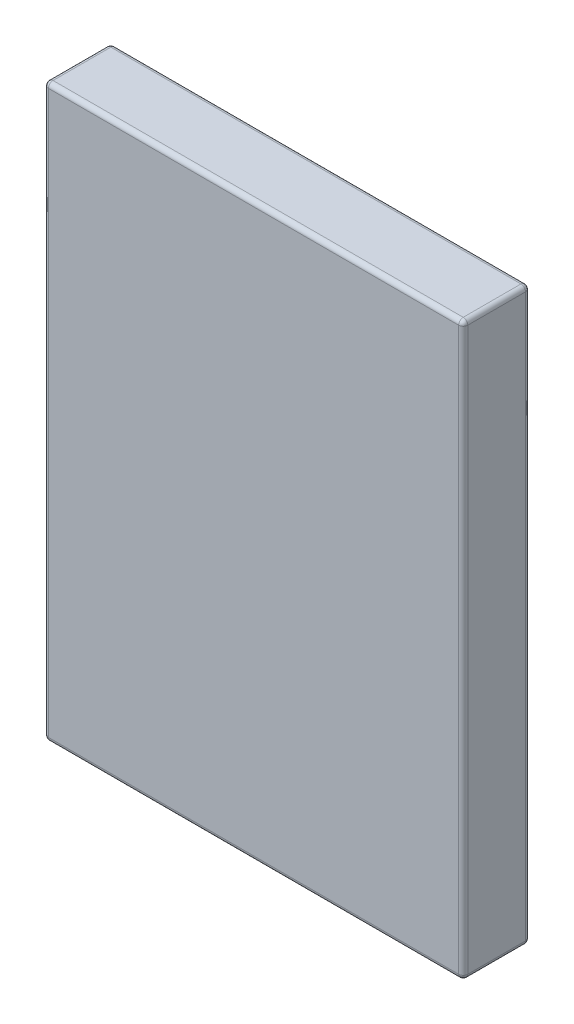
ISO-10303-21;
HEADER;
FILE_DESCRIPTION(('STEP AP214'),'2;1');
FILE_NAME('part.step','',(''),(''),'','','');
FILE_SCHEMA(('AUTOMOTIVE_DESIGN { 1 0 10303 214 1 1 1 1 }'));
ENDSEC;
DATA;
#1=APPLICATION_CONTEXT('core data for automotive mechanical design processes');
#2=APPLICATION_PROTOCOL_DEFINITION('international standard','automotive_design',2000,#1);
#3=PRODUCT_CONTEXT('',#1,'mechanical');
#4=PRODUCT('Part','Part','',(#3));
#5=PRODUCT_RELATED_PRODUCT_CATEGORY('part','',(#4));
#6=PRODUCT_DEFINITION_FORMATION('','',#4);
#7=PRODUCT_DEFINITION_CONTEXT('part definition',#1,'design');
#8=PRODUCT_DEFINITION('design','',#6,#7);
#9=PRODUCT_DEFINITION_SHAPE('','',#8);
#10=(LENGTH_UNIT() NAMED_UNIT(*) SI_UNIT(.MILLI.,.METRE.));
#11=(NAMED_UNIT(*) PLANE_ANGLE_UNIT() SI_UNIT($,.RADIAN.));
#12=(NAMED_UNIT(*) SI_UNIT($,.STERADIAN.) SOLID_ANGLE_UNIT());
#13=UNCERTAINTY_MEASURE_WITH_UNIT(LENGTH_MEASURE(1.E-05),#10,'distance_accuracy_value','');
#14=(GEOMETRIC_REPRESENTATION_CONTEXT(3) GLOBAL_UNCERTAINTY_ASSIGNED_CONTEXT((#13)) GLOBAL_UNIT_ASSIGNED_CONTEXT((#10,
#11,#12)) REPRESENTATION_CONTEXT('',''));
#15=CARTESIAN_POINT('',(0.,0.,0.));
#16=DIRECTION('',(0.,0.,1.));
#17=DIRECTION('',(1.,0.,0.));
#18=AXIS2_PLACEMENT_3D('',#15,#16,#17);
#19=CARTESIAN_POINT('',(0.,0.,220.));
#20=DIRECTION('',(1.,0.,0.));
#21=DIRECTION('',(0.,0.,-1.));
#22=AXIS2_PLACEMENT_3D('',#19,#20,#21);
#23=PLANE('',#22);
#24=DIRECTION('',(0.,-1.,0.));
#25=VECTOR('',#24,1.);
#26=CARTESIAN_POINT('',(0.,0.,15.));
#27=LINE('',#26,#25);
#28=CARTESIAN_POINT('',(0.,1865.,15.));
#29=VERTEX_POINT('',#28);
#30=CARTESIAN_POINT('',(0.,15.,15.));
#31=VERTEX_POINT('',#30);
#32=EDGE_CURVE('E262',#29,#31,#27,.T.);
#33=ORIENTED_EDGE('',*,*,#32,.T.);
#34=DIRECTION('',(0.,0.,-1.));
#35=VECTOR('',#34,1.);
#36=CARTESIAN_POINT('',(0.,15.,220.));
#37=LINE('',#36,#35);
#38=CARTESIAN_POINT('',(0.,15.,205.));
#39=VERTEX_POINT('',#38);
#40=EDGE_CURVE('E265',#31,#39,#37,.F.);
#41=ORIENTED_EDGE('',*,*,#40,.T.);
#42=DIRECTION('',(0.,-1.,0.));
#43=VECTOR('',#42,1.);
#44=CARTESIAN_POINT('',(0.,0.,205.));
#45=LINE('',#44,#43);
#46=CARTESIAN_POINT('',(0.,1865.,205.));
#47=VERTEX_POINT('',#46);
#48=EDGE_CURVE('E240',#39,#47,#45,.F.);
#49=ORIENTED_EDGE('',*,*,#48,.T.);
#50=DIRECTION('',(0.,0.,-1.));
#51=VECTOR('',#50,1.);
#52=CARTESIAN_POINT('',(0.,1865.,220.));
#53=LINE('',#52,#51);
#54=EDGE_CURVE('E259',#47,#29,#53,.T.);
#55=ORIENTED_EDGE('',*,*,#54,.T.);
#56=EDGE_LOOP('',(#33,#41,#49,#55));
#57=FACE_BOUND('',#56,.T.);
#58=ADVANCED_FACE('F39',(#57),#23,.F.);
#59=CARTESIAN_POINT('',(0.,0.,220.));
#60=DIRECTION('',(0.,1.,0.));
#61=DIRECTION('',(0.,0.,1.));
#62=AXIS2_PLACEMENT_3D('',#59,#60,#61);
#63=PLANE('',#62);
#64=DIRECTION('',(1.,0.,0.));
#65=VECTOR('',#64,1.);
#66=CARTESIAN_POINT('',(1380.,0.,15.));
#67=LINE('',#66,#65);
#68=CARTESIAN_POINT('',(15.,0.,15.));
#69=VERTEX_POINT('',#68);
#70=CARTESIAN_POINT('',(1365.,0.,15.));
#71=VERTEX_POINT('',#70);
#72=EDGE_CURVE('E308',#69,#71,#67,.T.);
#73=ORIENTED_EDGE('',*,*,#72,.T.);
#74=DIRECTION('',(0.,0.,-1.));
#75=VECTOR('',#74,1.);
#76=CARTESIAN_POINT('',(1365.,0.,220.));
#77=LINE('',#76,#75);
#78=CARTESIAN_POINT('',(1365.,0.,205.));
#79=VERTEX_POINT('',#78);
#80=EDGE_CURVE('E312',#71,#79,#77,.F.);
#81=ORIENTED_EDGE('',*,*,#80,.T.);
#82=DIRECTION('',(1.,0.,0.));
#83=VECTOR('',#82,1.);
#84=CARTESIAN_POINT('',(0.,0.,205.));
#85=LINE('',#84,#83);
#86=CARTESIAN_POINT('',(15.,0.,205.));
#87=VERTEX_POINT('',#86);
#88=EDGE_CURVE('E302',#79,#87,#85,.F.);
#89=ORIENTED_EDGE('',*,*,#88,.T.);
#90=DIRECTION('',(0.,0.,-1.));
#91=VECTOR('',#90,1.);
#92=CARTESIAN_POINT('',(15.,0.,220.));
#93=LINE('',#92,#91);
#94=EDGE_CURVE('E309',#87,#69,#93,.T.);
#95=ORIENTED_EDGE('',*,*,#94,.T.);
#96=EDGE_LOOP('',(#73,#81,#89,#95));
#97=FACE_BOUND('',#96,.T.);
#98=ADVANCED_FACE('F313',(#97),#63,.F.);
#99=CARTESIAN_POINT('',(1380.,0.,220.));
#100=DIRECTION('',(-1.,0.,0.));
#101=DIRECTION('',(0.,0.,1.));
#102=AXIS2_PLACEMENT_3D('',#99,#100,#101);
#103=PLANE('',#102);
#104=DIRECTION('',(0.,1.,0.));
#105=VECTOR('',#104,1.);
#106=CARTESIAN_POINT('',(1380.,0.,205.));
#107=LINE('',#106,#105);
#108=CARTESIAN_POINT('',(1380.,1865.,205.));
#109=VERTEX_POINT('',#108);
#110=CARTESIAN_POINT('',(1380.,15.,205.));
#111=VERTEX_POINT('',#110);
#112=EDGE_CURVE('E142',#109,#111,#107,.F.);
#113=ORIENTED_EDGE('',*,*,#112,.T.);
#114=DIRECTION('',(0.,0.,-1.));
#115=VECTOR('',#114,1.);
#116=CARTESIAN_POINT('',(1380.,15.,220.));
#117=LINE('',#116,#115);
#118=CARTESIAN_POINT('',(1380.,15.,15.));
#119=VERTEX_POINT('',#118);
#120=EDGE_CURVE('E137',#111,#119,#117,.T.);
#121=ORIENTED_EDGE('',*,*,#120,.T.);
#122=DIRECTION('',(0.,1.,0.));
#123=VECTOR('',#122,1.);
#124=CARTESIAN_POINT('',(1380.,1880.,15.));
#125=LINE('',#124,#123);
#126=CARTESIAN_POINT('',(1380.,1865.,15.));
#127=VERTEX_POINT('',#126);
#128=EDGE_CURVE('E131',#119,#127,#125,.T.);
#129=ORIENTED_EDGE('',*,*,#128,.T.);
#130=DIRECTION('',(0.,0.,-1.));
#131=VECTOR('',#130,1.);
#132=CARTESIAN_POINT('',(1380.,1865.,220.));
#133=LINE('',#132,#131);
#134=EDGE_CURVE('E134',#127,#109,#133,.F.);
#135=ORIENTED_EDGE('',*,*,#134,.T.);
#136=EDGE_LOOP('',(#113,#121,#129,#135));
#137=FACE_BOUND('',#136,.T.);
#138=ADVANCED_FACE('F133',(#137),#103,.F.);
#139=CARTESIAN_POINT('',(0.,1880.,220.));
#140=DIRECTION('',(0.,-1.,0.));
#141=DIRECTION('',(0.,0.,-1.));
#142=AXIS2_PLACEMENT_3D('',#139,#140,#141);
#143=PLANE('',#142);
#144=DIRECTION('',(-1.,0.,0.));
#145=VECTOR('',#144,1.);
#146=CARTESIAN_POINT('',(0.,1880.,15.));
#147=LINE('',#146,#145);
#148=CARTESIAN_POINT('',(1365.,1880.,15.));
#149=VERTEX_POINT('',#148);
#150=CARTESIAN_POINT('',(15.,1880.,15.));
#151=VERTEX_POINT('',#150);
#152=EDGE_CURVE('E49',#149,#151,#147,.T.);
#153=ORIENTED_EDGE('',*,*,#152,.T.);
#154=DIRECTION('',(0.,0.,-1.));
#155=VECTOR('',#154,1.);
#156=CARTESIAN_POINT('',(15.,1880.,220.));
#157=LINE('',#156,#155);
#158=CARTESIAN_POINT('',(15.,1880.,205.));
#159=VERTEX_POINT('',#158);
#160=EDGE_CURVE('E11',#151,#159,#157,.F.);
#161=ORIENTED_EDGE('',*,*,#160,.T.);
#162=DIRECTION('',(-1.,0.,0.));
#163=VECTOR('',#162,1.);
#164=CARTESIAN_POINT('',(0.,1880.,205.));
#165=LINE('',#164,#163);
#166=CARTESIAN_POINT('',(1365.,1880.,205.));
#167=VERTEX_POINT('',#166);
#168=EDGE_CURVE('E63',#159,#167,#165,.F.);
#169=ORIENTED_EDGE('',*,*,#168,.T.);
#170=DIRECTION('',(0.,0.,-1.));
#171=VECTOR('',#170,1.);
#172=CARTESIAN_POINT('',(1365.,1880.,220.));
#173=LINE('',#172,#171);
#174=EDGE_CURVE('E268',#167,#149,#173,.T.);
#175=ORIENTED_EDGE('',*,*,#174,.T.);
#176=EDGE_LOOP('',(#153,#161,#169,#175));
#177=FACE_BOUND('',#176,.T.);
#178=ADVANCED_FACE('F381',(#177),#143,.F.);
#179=CARTESIAN_POINT('',(0.,0.,220.));
#180=DIRECTION('',(0.,0.,-1.));
#181=DIRECTION('',(-1.,0.,0.));
#182=AXIS2_PLACEMENT_3D('',#179,#180,#181);
#183=PLANE('',#182);
#184=DIRECTION('',(0.,-1.,0.));
#185=VECTOR('',#184,1.);
#186=CARTESIAN_POINT('',(15.,0.,220.));
#187=LINE('',#186,#185);
#188=CARTESIAN_POINT('',(15.,1865.,220.));
#189=VERTEX_POINT('',#188);
#190=CARTESIAN_POINT('',(15.,15.,220.));
#191=VERTEX_POINT('',#190);
#192=EDGE_CURVE('E242',#189,#191,#187,.T.);
#193=ORIENTED_EDGE('',*,*,#192,.T.);
#194=DIRECTION('',(1.,0.,0.));
#195=VECTOR('',#194,1.);
#196=CARTESIAN_POINT('',(0.,15.,220.));
#197=LINE('',#196,#195);
#198=CARTESIAN_POINT('',(1365.,15.,220.));
#199=VERTEX_POINT('',#198);
#200=EDGE_CURVE('E247',#191,#199,#197,.T.);
#201=ORIENTED_EDGE('',*,*,#200,.T.);
#202=DIRECTION('',(0.,1.,0.));
#203=VECTOR('',#202,1.);
#204=CARTESIAN_POINT('',(1365.,0.,220.));
#205=LINE('',#204,#203);
#206=CARTESIAN_POINT('',(1365.,1865.,220.));
#207=VERTEX_POINT('',#206);
#208=EDGE_CURVE('E253',#199,#207,#205,.T.);
#209=ORIENTED_EDGE('',*,*,#208,.T.);
#210=DIRECTION('',(-1.,0.,0.));
#211=VECTOR('',#210,1.);
#212=CARTESIAN_POINT('',(0.,1865.,220.));
#213=LINE('',#212,#211);
#214=EDGE_CURVE('E248',#207,#189,#213,.T.);
#215=ORIENTED_EDGE('',*,*,#214,.T.);
#216=EDGE_LOOP('',(#193,#201,#209,#215));
#217=FACE_BOUND('',#216,.T.);
#218=ADVANCED_FACE('F336',(#217),#183,.F.);
#219=CARTESIAN_POINT('',(0.,0.,0.));
#220=DIRECTION('',(0.,0.,-1.));
#221=DIRECTION('',(-1.,0.,0.));
#222=AXIS2_PLACEMENT_3D('',#219,#220,#221);
#223=PLANE('',#222);
#224=DIRECTION('',(0.,1.,0.));
#225=VECTOR('',#224,1.);
#226=CARTESIAN_POINT('',(1365.,0.,0.));
#227=LINE('',#226,#225);
#228=CARTESIAN_POINT('',(1365.,1865.,0.));
#229=VERTEX_POINT('',#228);
#230=CARTESIAN_POINT('',(1365.,15.,0.));
#231=VERTEX_POINT('',#230);
#232=EDGE_CURVE('E166',#229,#231,#227,.F.);
#233=ORIENTED_EDGE('',*,*,#232,.T.);
#234=DIRECTION('',(1.,0.,0.));
#235=VECTOR('',#234,1.);
#236=CARTESIAN_POINT('',(0.,15.,0.));
#237=LINE('',#236,#235);
#238=CARTESIAN_POINT('',(15.,15.,0.));
#239=VERTEX_POINT('',#238);
#240=EDGE_CURVE('E331',#231,#239,#237,.F.);
#241=ORIENTED_EDGE('',*,*,#240,.T.);
#242=DIRECTION('',(0.,-1.,0.));
#243=VECTOR('',#242,1.);
#244=CARTESIAN_POINT('',(15.,1880.,0.));
#245=LINE('',#244,#243);
#246=CARTESIAN_POINT('',(15.,1865.,0.));
#247=VERTEX_POINT('',#246);
#248=EDGE_CURVE('E328',#239,#247,#245,.F.);
#249=ORIENTED_EDGE('',*,*,#248,.T.);
#250=DIRECTION('',(-1.,0.,0.));
#251=VECTOR('',#250,1.);
#252=CARTESIAN_POINT('',(1380.,1865.,0.));
#253=LINE('',#252,#251);
#254=EDGE_CURVE('E322',#247,#229,#253,.F.);
#255=ORIENTED_EDGE('',*,*,#254,.T.);
#256=EDGE_LOOP('',(#233,#241,#249,#255));
#257=FACE_BOUND('',#256,.T.);
#258=ADVANCED_FACE('F384',(#257),#223,.T.);
#259=CARTESIAN_POINT('',(15.,1865.,220.));
#260=DIRECTION('',(0.,0.,-1.));
#261=DIRECTION('',(-1.,0.,0.));
#262=AXIS2_PLACEMENT_3D('',#259,#260,#261);
#263=CYLINDRICAL_SURFACE('',#262,15.);
#264=CARTESIAN_POINT('',(15.,1865.,205.));
#265=DIRECTION('',(0.,0.,1.));
#266=DIRECTION('',(1.,0.,0.));
#267=AXIS2_PLACEMENT_3D('',#264,#265,#266);
#268=CIRCLE('',#267,15.);
#269=EDGE_CURVE('E43',#159,#47,#268,.T.);
#270=ORIENTED_EDGE('',*,*,#269,.F.);
#271=ORIENTED_EDGE('',*,*,#160,.F.);
#272=CARTESIAN_POINT('',(15.,1865.,15.));
#273=DIRECTION('',(0.,0.,-1.));
#274=DIRECTION('',(-1.,0.,0.));
#275=AXIS2_PLACEMENT_3D('',#272,#273,#274);
#276=CIRCLE('',#275,15.);
#277=EDGE_CURVE('E220',#29,#151,#276,.T.);
#278=ORIENTED_EDGE('',*,*,#277,.F.);
#279=ORIENTED_EDGE('',*,*,#54,.F.);
#280=EDGE_LOOP('',(#270,#271,#278,#279));
#281=FACE_BOUND('',#280,.T.);
#282=ADVANCED_FACE('F41',(#281),#263,.T.);
#283=CARTESIAN_POINT('',(15.,1865.,205.));
#284=DIRECTION('',(0.,0.,1.));
#285=DIRECTION('',(1.,0.,0.));
#286=AXIS2_PLACEMENT_3D('',#283,#284,#285);
#287=SPHERICAL_SURFACE('',#286,15.);
#288=CARTESIAN_POINT('',(15.,1865.,205.));
#289=DIRECTION('',(-1.,0.,0.));
#290=DIRECTION('',(0.,0.,1.));
#291=AXIS2_PLACEMENT_3D('',#288,#289,#290);
#292=CIRCLE('',#291,15.);
#293=EDGE_CURVE('E214',#159,#189,#292,.F.);
#294=ORIENTED_EDGE('',*,*,#293,.F.);
#295=ORIENTED_EDGE('',*,*,#269,.T.);
#296=CARTESIAN_POINT('',(15.,1865.,205.));
#297=DIRECTION('',(0.,1.,0.));
#298=DIRECTION('',(0.,0.,1.));
#299=AXIS2_PLACEMENT_3D('',#296,#297,#298);
#300=CIRCLE('',#299,15.);
#301=EDGE_CURVE('E217',#189,#47,#300,.F.);
#302=ORIENTED_EDGE('',*,*,#301,.F.);
#303=EDGE_LOOP('',(#294,#295,#302));
#304=FACE_BOUND('',#303,.T.);
#305=ADVANCED_FACE('F232',(#304),#287,.T.);
#306=CARTESIAN_POINT('',(15.,1865.,15.));
#307=DIRECTION('',(0.,0.,1.));
#308=DIRECTION('',(1.,0.,0.));
#309=AXIS2_PLACEMENT_3D('',#306,#307,#308);
#310=SPHERICAL_SURFACE('',#309,15.);
#311=CARTESIAN_POINT('',(15.,1865.,15.));
#312=DIRECTION('',(0.,1.,0.));
#313=DIRECTION('',(0.,0.,1.));
#314=AXIS2_PLACEMENT_3D('',#311,#312,#313);
#315=CIRCLE('',#314,15.);
#316=EDGE_CURVE('E206',#29,#247,#315,.F.);
#317=ORIENTED_EDGE('',*,*,#316,.F.);
#318=ORIENTED_EDGE('',*,*,#277,.T.);
#319=CARTESIAN_POINT('',(15.,1865.,15.));
#320=DIRECTION('',(-1.,0.,0.));
#321=DIRECTION('',(0.,0.,1.));
#322=AXIS2_PLACEMENT_3D('',#319,#320,#321);
#323=CIRCLE('',#322,15.);
#324=EDGE_CURVE('E210',#247,#151,#323,.F.);
#325=ORIENTED_EDGE('',*,*,#324,.F.);
#326=EDGE_LOOP('',(#317,#318,#325));
#327=FACE_BOUND('',#326,.T.);
#328=ADVANCED_FACE('F408',(#327),#310,.T.);
#329=CARTESIAN_POINT('',(15.,0.,205.));
#330=DIRECTION('',(0.,-1.,0.));
#331=DIRECTION('',(0.,0.,-1.));
#332=AXIS2_PLACEMENT_3D('',#329,#330,#331);
#333=CYLINDRICAL_SURFACE('',#332,15.);
#334=ORIENTED_EDGE('',*,*,#301,.T.);
#335=ORIENTED_EDGE('',*,*,#48,.F.);
#336=CARTESIAN_POINT('',(15.,15.,205.));
#337=DIRECTION('',(0.,-1.,0.));
#338=DIRECTION('',(0.,0.,-1.));
#339=AXIS2_PLACEMENT_3D('',#336,#337,#338);
#340=CIRCLE('',#339,15.);
#341=EDGE_CURVE('E199',#191,#39,#340,.T.);
#342=ORIENTED_EDGE('',*,*,#341,.F.);
#343=ORIENTED_EDGE('',*,*,#192,.F.);
#344=EDGE_LOOP('',(#334,#335,#342,#343));
#345=FACE_BOUND('',#344,.T.);
#346=ADVANCED_FACE('F238',(#345),#333,.T.);
#347=CARTESIAN_POINT('',(0.,1865.,205.));
#348=DIRECTION('',(-1.,0.,0.));
#349=DIRECTION('',(0.,0.,1.));
#350=AXIS2_PLACEMENT_3D('',#347,#348,#349);
#351=CYLINDRICAL_SURFACE('',#350,15.);
#352=ORIENTED_EDGE('',*,*,#293,.T.);
#353=ORIENTED_EDGE('',*,*,#214,.F.);
#354=CARTESIAN_POINT('',(1365.,1865.,205.));
#355=DIRECTION('',(1.,0.,0.));
#356=DIRECTION('',(0.,0.,-1.));
#357=AXIS2_PLACEMENT_3D('',#354,#355,#356);
#358=CIRCLE('',#357,15.);
#359=EDGE_CURVE('E195',#167,#207,#358,.T.);
#360=ORIENTED_EDGE('',*,*,#359,.F.);
#361=ORIENTED_EDGE('',*,*,#168,.F.);
#362=EDGE_LOOP('',(#352,#353,#360,#361));
#363=FACE_BOUND('',#362,.T.);
#364=ADVANCED_FACE('F338',(#363),#351,.T.);
#365=CARTESIAN_POINT('',(1365.,1865.,220.));
#366=DIRECTION('',(0.,0.,-1.));
#367=DIRECTION('',(-1.,0.,0.));
#368=AXIS2_PLACEMENT_3D('',#365,#366,#367);
#369=CYLINDRICAL_SURFACE('',#368,15.);
#370=CARTESIAN_POINT('',(1365.,1865.,15.));
#371=DIRECTION('',(0.,0.,-1.));
#372=DIRECTION('',(-1.,0.,0.));
#373=AXIS2_PLACEMENT_3D('',#370,#371,#372);
#374=CIRCLE('',#373,15.);
#375=EDGE_CURVE('E149',#149,#127,#374,.T.);
#376=ORIENTED_EDGE('',*,*,#375,.F.);
#377=ORIENTED_EDGE('',*,*,#174,.F.);
#378=CARTESIAN_POINT('',(1365.,1865.,205.));
#379=DIRECTION('',(0.,0.,1.));
#380=DIRECTION('',(1.,0.,0.));
#381=AXIS2_PLACEMENT_3D('',#378,#379,#380);
#382=CIRCLE('',#381,15.);
#383=EDGE_CURVE('E152',#109,#167,#382,.T.);
#384=ORIENTED_EDGE('',*,*,#383,.F.);
#385=ORIENTED_EDGE('',*,*,#134,.F.);
#386=EDGE_LOOP('',(#376,#377,#384,#385));
#387=FACE_BOUND('',#386,.T.);
#388=ADVANCED_FACE('F147',(#387),#369,.T.);
#389=CARTESIAN_POINT('',(0.,1865.,15.));
#390=DIRECTION('',(1.,0.,0.));
#391=DIRECTION('',(0.,0.,-1.));
#392=AXIS2_PLACEMENT_3D('',#389,#390,#391);
#393=CYLINDRICAL_SURFACE('',#392,15.);
#394=ORIENTED_EDGE('',*,*,#324,.T.);
#395=ORIENTED_EDGE('',*,*,#152,.F.);
#396=CARTESIAN_POINT('',(1365.,1865.,15.));
#397=DIRECTION('',(1.,0.,0.));
#398=DIRECTION('',(0.,0.,-1.));
#399=AXIS2_PLACEMENT_3D('',#396,#397,#398);
#400=CIRCLE('',#399,15.);
#401=EDGE_CURVE('E162',#229,#149,#400,.T.);
#402=ORIENTED_EDGE('',*,*,#401,.F.);
#403=ORIENTED_EDGE('',*,*,#254,.F.);
#404=EDGE_LOOP('',(#394,#395,#402,#403));
#405=FACE_BOUND('',#404,.T.);
#406=ADVANCED_FACE('F432',(#405),#393,.T.);
#407=CARTESIAN_POINT('',(15.,0.,15.));
#408=DIRECTION('',(0.,1.,0.));
#409=DIRECTION('',(0.,0.,1.));
#410=AXIS2_PLACEMENT_3D('',#407,#408,#409);
#411=CYLINDRICAL_SURFACE('',#410,15.);
#412=ORIENTED_EDGE('',*,*,#316,.T.);
#413=ORIENTED_EDGE('',*,*,#248,.F.);
#414=CARTESIAN_POINT('',(15.,15.,15.));
#415=DIRECTION('',(0.,-1.,0.));
#416=DIRECTION('',(0.,0.,-1.));
#417=AXIS2_PLACEMENT_3D('',#414,#415,#416);
#418=CIRCLE('',#417,15.);
#419=EDGE_CURVE('E187',#31,#239,#418,.T.);
#420=ORIENTED_EDGE('',*,*,#419,.F.);
#421=ORIENTED_EDGE('',*,*,#32,.F.);
#422=EDGE_LOOP('',(#412,#413,#420,#421));
#423=FACE_BOUND('',#422,.T.);
#424=ADVANCED_FACE('F439',(#423),#411,.T.);
#425=CARTESIAN_POINT('',(15.,15.,220.));
#426=DIRECTION('',(0.,0.,-1.));
#427=DIRECTION('',(-1.,0.,0.));
#428=AXIS2_PLACEMENT_3D('',#425,#426,#427);
#429=CYLINDRICAL_SURFACE('',#428,15.);
#430=CARTESIAN_POINT('',(15.,15.,205.));
#431=DIRECTION('',(0.,0.,1.));
#432=DIRECTION('',(1.,0.,0.));
#433=AXIS2_PLACEMENT_3D('',#430,#431,#432);
#434=CIRCLE('',#433,15.);
#435=EDGE_CURVE('E202',#39,#87,#434,.T.);
#436=ORIENTED_EDGE('',*,*,#435,.F.);
#437=ORIENTED_EDGE('',*,*,#40,.F.);
#438=CARTESIAN_POINT('',(15.,15.,15.));
#439=DIRECTION('',(0.,0.,-1.));
#440=DIRECTION('',(-1.,0.,0.));
#441=AXIS2_PLACEMENT_3D('',#438,#439,#440);
#442=CIRCLE('',#441,15.);
#443=EDGE_CURVE('E183',#69,#31,#442,.T.);
#444=ORIENTED_EDGE('',*,*,#443,.F.);
#445=ORIENTED_EDGE('',*,*,#94,.F.);
#446=EDGE_LOOP('',(#436,#437,#444,#445));
#447=FACE_BOUND('',#446,.T.);
#448=ADVANCED_FACE('F354',(#447),#429,.T.);
#449=CARTESIAN_POINT('',(15.,15.,205.));
#450=DIRECTION('',(0.,0.,1.));
#451=DIRECTION('',(1.,0.,0.));
#452=AXIS2_PLACEMENT_3D('',#449,#450,#451);
#453=SPHERICAL_SURFACE('',#452,15.);
#454=ORIENTED_EDGE('',*,*,#341,.T.);
#455=ORIENTED_EDGE('',*,*,#435,.T.);
#456=CARTESIAN_POINT('',(15.,15.,205.));
#457=DIRECTION('',(-1.,0.,0.));
#458=DIRECTION('',(0.,0.,1.));
#459=AXIS2_PLACEMENT_3D('',#456,#457,#458);
#460=CIRCLE('',#459,15.);
#461=EDGE_CURVE('E174',#191,#87,#460,.F.);
#462=ORIENTED_EDGE('',*,*,#461,.F.);
#463=EDGE_LOOP('',(#454,#455,#462));
#464=FACE_BOUND('',#463,.T.);
#465=ADVANCED_FACE('F454',(#464),#453,.T.);
#466=CARTESIAN_POINT('',(1365.,1865.,205.));
#467=DIRECTION('',(0.,0.,1.));
#468=DIRECTION('',(1.,0.,0.));
#469=AXIS2_PLACEMENT_3D('',#466,#467,#468);
#470=SPHERICAL_SURFACE('',#469,15.);
#471=ORIENTED_EDGE('',*,*,#383,.T.);
#472=ORIENTED_EDGE('',*,*,#359,.T.);
#473=CARTESIAN_POINT('',(1365.,1865.,205.));
#474=DIRECTION('',(0.,1.,0.));
#475=DIRECTION('',(0.,0.,1.));
#476=AXIS2_PLACEMENT_3D('',#473,#474,#475);
#477=CIRCLE('',#476,15.);
#478=EDGE_CURVE('E168',#109,#207,#477,.F.);
#479=ORIENTED_EDGE('',*,*,#478,.F.);
#480=EDGE_LOOP('',(#471,#472,#479));
#481=FACE_BOUND('',#480,.T.);
#482=ADVANCED_FACE('F340',(#481),#470,.T.);
#483=CARTESIAN_POINT('',(1365.,1865.,15.));
#484=DIRECTION('',(0.,0.,1.));
#485=DIRECTION('',(1.,0.,0.));
#486=AXIS2_PLACEMENT_3D('',#483,#484,#485);
#487=SPHERICAL_SURFACE('',#486,15.);
#488=ORIENTED_EDGE('',*,*,#401,.T.);
#489=ORIENTED_EDGE('',*,*,#375,.T.);
#490=CARTESIAN_POINT('',(1365.,1865.,15.));
#491=DIRECTION('',(0.,1.,0.));
#492=DIRECTION('',(0.,0.,1.));
#493=AXIS2_PLACEMENT_3D('',#490,#491,#492);
#494=CIRCLE('',#493,15.);
#495=EDGE_CURVE('E159',#229,#127,#494,.F.);
#496=ORIENTED_EDGE('',*,*,#495,.F.);
#497=EDGE_LOOP('',(#488,#489,#496));
#498=FACE_BOUND('',#497,.T.);
#499=ADVANCED_FACE('F158',(#498),#487,.T.);
#500=CARTESIAN_POINT('',(15.,15.,15.));
#501=DIRECTION('',(0.,0.,1.));
#502=DIRECTION('',(1.,0.,0.));
#503=AXIS2_PLACEMENT_3D('',#500,#501,#502);
#504=SPHERICAL_SURFACE('',#503,15.);
#505=ORIENTED_EDGE('',*,*,#443,.T.);
#506=ORIENTED_EDGE('',*,*,#419,.T.);
#507=CARTESIAN_POINT('',(15.,15.,15.));
#508=DIRECTION('',(-1.,0.,0.));
#509=DIRECTION('',(0.,0.,1.));
#510=AXIS2_PLACEMENT_3D('',#507,#508,#509);
#511=CIRCLE('',#510,15.);
#512=EDGE_CURVE('E169',#69,#239,#511,.F.);
#513=ORIENTED_EDGE('',*,*,#512,.F.);
#514=EDGE_LOOP('',(#505,#506,#513));
#515=FACE_BOUND('',#514,.T.);
#516=ADVANCED_FACE('F357',(#515),#504,.T.);
#517=CARTESIAN_POINT('',(0.,15.,205.));
#518=DIRECTION('',(1.,0.,0.));
#519=DIRECTION('',(0.,0.,-1.));
#520=AXIS2_PLACEMENT_3D('',#517,#518,#519);
#521=CYLINDRICAL_SURFACE('',#520,15.);
#522=ORIENTED_EDGE('',*,*,#461,.T.);
#523=ORIENTED_EDGE('',*,*,#88,.F.);
#524=CARTESIAN_POINT('',(1365.,15.,205.));
#525=DIRECTION('',(1.,0.,0.));
#526=DIRECTION('',(0.,0.,-1.));
#527=AXIS2_PLACEMENT_3D('',#524,#525,#526);
#528=CIRCLE('',#527,15.);
#529=EDGE_CURVE('E176',#199,#79,#528,.T.);
#530=ORIENTED_EDGE('',*,*,#529,.F.);
#531=ORIENTED_EDGE('',*,*,#200,.F.);
#532=EDGE_LOOP('',(#522,#523,#530,#531));
#533=FACE_BOUND('',#532,.T.);
#534=ADVANCED_FACE('F304',(#533),#521,.T.);
#535=CARTESIAN_POINT('',(1365.,0.,205.));
#536=DIRECTION('',(0.,1.,0.));
#537=DIRECTION('',(0.,0.,1.));
#538=AXIS2_PLACEMENT_3D('',#535,#536,#537);
#539=CYLINDRICAL_SURFACE('',#538,15.);
#540=ORIENTED_EDGE('',*,*,#478,.T.);
#541=ORIENTED_EDGE('',*,*,#208,.F.);
#542=CARTESIAN_POINT('',(1365.,15.,205.));
#543=DIRECTION('',(0.,-1.,0.));
#544=DIRECTION('',(0.,0.,-1.));
#545=AXIS2_PLACEMENT_3D('',#542,#543,#544);
#546=CIRCLE('',#545,15.);
#547=EDGE_CURVE('E289',#111,#199,#546,.T.);
#548=ORIENTED_EDGE('',*,*,#547,.F.);
#549=ORIENTED_EDGE('',*,*,#112,.F.);
#550=EDGE_LOOP('',(#540,#541,#548,#549));
#551=FACE_BOUND('',#550,.T.);
#552=ADVANCED_FACE('F342',(#551),#539,.T.);
#553=CARTESIAN_POINT('',(1365.,0.,15.));
#554=DIRECTION('',(0.,-1.,0.));
#555=DIRECTION('',(0.,0.,-1.));
#556=AXIS2_PLACEMENT_3D('',#553,#554,#555);
#557=CYLINDRICAL_SURFACE('',#556,15.);
#558=ORIENTED_EDGE('',*,*,#495,.T.);
#559=ORIENTED_EDGE('',*,*,#128,.F.);
#560=CARTESIAN_POINT('',(1365.,15.,15.));
#561=DIRECTION('',(0.,-1.,0.));
#562=DIRECTION('',(0.,0.,-1.));
#563=AXIS2_PLACEMENT_3D('',#560,#561,#562);
#564=CIRCLE('',#563,15.);
#565=EDGE_CURVE('E285',#231,#119,#564,.T.);
#566=ORIENTED_EDGE('',*,*,#565,.F.);
#567=ORIENTED_EDGE('',*,*,#232,.F.);
#568=EDGE_LOOP('',(#558,#559,#566,#567));
#569=FACE_BOUND('',#568,.T.);
#570=ADVANCED_FACE('F165',(#569),#557,.T.);
#571=CARTESIAN_POINT('',(0.,15.,15.));
#572=DIRECTION('',(-1.,0.,0.));
#573=DIRECTION('',(0.,0.,1.));
#574=AXIS2_PLACEMENT_3D('',#571,#572,#573);
#575=CYLINDRICAL_SURFACE('',#574,15.);
#576=ORIENTED_EDGE('',*,*,#512,.T.);
#577=ORIENTED_EDGE('',*,*,#240,.F.);
#578=CARTESIAN_POINT('',(1365.,15.,15.));
#579=DIRECTION('',(1.,0.,0.));
#580=DIRECTION('',(0.,0.,-1.));
#581=AXIS2_PLACEMENT_3D('',#578,#579,#580);
#582=CIRCLE('',#581,15.);
#583=EDGE_CURVE('E281',#71,#231,#582,.T.);
#584=ORIENTED_EDGE('',*,*,#583,.F.);
#585=ORIENTED_EDGE('',*,*,#72,.F.);
#586=EDGE_LOOP('',(#576,#577,#584,#585));
#587=FACE_BOUND('',#586,.T.);
#588=ADVANCED_FACE('F361',(#587),#575,.T.);
#589=CARTESIAN_POINT('',(1365.,15.,205.));
#590=DIRECTION('',(0.,0.,1.));
#591=DIRECTION('',(1.,0.,0.));
#592=AXIS2_PLACEMENT_3D('',#589,#590,#591);
#593=SPHERICAL_SURFACE('',#592,15.);
#594=ORIENTED_EDGE('',*,*,#547,.T.);
#595=ORIENTED_EDGE('',*,*,#529,.T.);
#596=CARTESIAN_POINT('',(1365.,15.,205.));
#597=DIRECTION('',(0.,0.,1.));
#598=DIRECTION('',(1.,0.,0.));
#599=AXIS2_PLACEMENT_3D('',#596,#597,#598);
#600=CIRCLE('',#599,15.);
#601=EDGE_CURVE('E278',#111,#79,#600,.F.);
#602=ORIENTED_EDGE('',*,*,#601,.F.);
#603=EDGE_LOOP('',(#594,#595,#602));
#604=FACE_BOUND('',#603,.T.);
#605=ADVANCED_FACE('F297',(#604),#593,.T.);
#606=CARTESIAN_POINT('',(1365.,15.,15.));
#607=DIRECTION('',(0.,0.,1.));
#608=DIRECTION('',(1.,0.,0.));
#609=AXIS2_PLACEMENT_3D('',#606,#607,#608);
#610=SPHERICAL_SURFACE('',#609,15.);
#611=ORIENTED_EDGE('',*,*,#583,.T.);
#612=ORIENTED_EDGE('',*,*,#565,.T.);
#613=CARTESIAN_POINT('',(1365.,15.,15.));
#614=DIRECTION('',(0.,0.,-1.));
#615=DIRECTION('',(-1.,0.,0.));
#616=AXIS2_PLACEMENT_3D('',#613,#614,#615);
#617=CIRCLE('',#616,15.);
#618=EDGE_CURVE('E275',#71,#119,#617,.F.);
#619=ORIENTED_EDGE('',*,*,#618,.F.);
#620=EDGE_LOOP('',(#611,#612,#619));
#621=FACE_BOUND('',#620,.T.);
#622=ADVANCED_FACE('F363',(#621),#610,.T.);
#623=CARTESIAN_POINT('',(1365.,15.,220.));
#624=DIRECTION('',(0.,0.,-1.));
#625=DIRECTION('',(-1.,0.,0.));
#626=AXIS2_PLACEMENT_3D('',#623,#624,#625);
#627=CYLINDRICAL_SURFACE('',#626,15.);
#628=ORIENTED_EDGE('',*,*,#601,.T.);
#629=ORIENTED_EDGE('',*,*,#80,.F.);
#630=ORIENTED_EDGE('',*,*,#618,.T.);
#631=ORIENTED_EDGE('',*,*,#120,.F.);
#632=EDGE_LOOP('',(#628,#629,#630,#631));
#633=FACE_BOUND('',#632,.T.);
#634=ADVANCED_FACE('F364',(#633),#627,.T.);
#635=CLOSED_SHELL('',(#58,#98,#138,#178,#218,#258,#282,#305,#328,#346,#364,#388,#406,#424,#448,
#465,#482,#499,#516,#534,#552,#570,#588,#605,#622,#634));
#636=MANIFOLD_SOLID_BREP('B2',#635);
#637=ADVANCED_BREP_SHAPE_REPRESENTATION('',(#18,#636),#14);
#638=SHAPE_DEFINITION_REPRESENTATION(#9,#637);
ENDSEC;
END-ISO-10303-21;
